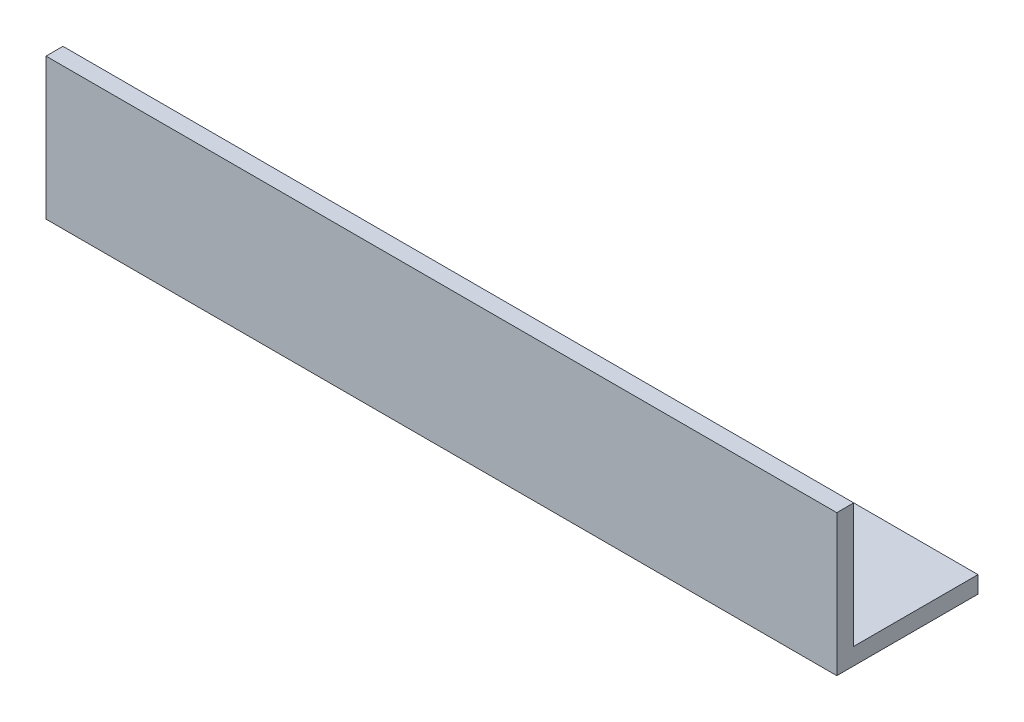
ISO-10303-21;
HEADER;
FILE_DESCRIPTION(('STEP AP214'),'2;1');
FILE_NAME('part.step','',(''),(''),'','','');
FILE_SCHEMA(('AUTOMOTIVE_DESIGN { 1 0 10303 214 1 1 1 1 }'));
ENDSEC;
DATA;
#1=APPLICATION_CONTEXT('core data for automotive mechanical design processes');
#2=APPLICATION_PROTOCOL_DEFINITION('international standard','automotive_design',2000,#1);
#3=PRODUCT_CONTEXT('',#1,'mechanical');
#4=PRODUCT('Part','Part','',(#3));
#5=PRODUCT_RELATED_PRODUCT_CATEGORY('part','',(#4));
#6=PRODUCT_DEFINITION_FORMATION('','',#4);
#7=PRODUCT_DEFINITION_CONTEXT('part definition',#1,'design');
#8=PRODUCT_DEFINITION('design','',#6,#7);
#9=PRODUCT_DEFINITION_SHAPE('','',#8);
#10=(LENGTH_UNIT() NAMED_UNIT(*) SI_UNIT(.MILLI.,.METRE.));
#11=(NAMED_UNIT(*) PLANE_ANGLE_UNIT() SI_UNIT($,.RADIAN.));
#12=(NAMED_UNIT(*) SI_UNIT($,.STERADIAN.) SOLID_ANGLE_UNIT());
#13=UNCERTAINTY_MEASURE_WITH_UNIT(LENGTH_MEASURE(1.E-05),#10,'distance_accuracy_value','');
#14=(GEOMETRIC_REPRESENTATION_CONTEXT(3) GLOBAL_UNCERTAINTY_ASSIGNED_CONTEXT((#13)) GLOBAL_UNIT_ASSIGNED_CONTEXT((#10,
#11,#12)) REPRESENTATION_CONTEXT('',''));
#15=CARTESIAN_POINT('',(0.,0.,0.));
#16=DIRECTION('',(0.,0.,1.));
#17=DIRECTION('',(1.,0.,0.));
#18=AXIS2_PLACEMENT_3D('',#15,#16,#17);
#19=CARTESIAN_POINT('',(140.,25.,-3.));
#20=DIRECTION('',(0.,-1.,0.));
#21=DIRECTION('',(0.,0.,-1.));
#22=AXIS2_PLACEMENT_3D('',#19,#20,#21);
#23=PLANE('',#22);
#24=DIRECTION('',(0.,0.,1.));
#25=VECTOR('',#24,1.);
#26=CARTESIAN_POINT('',(0.,25.,-3.));
#27=LINE('',#26,#25);
#28=CARTESIAN_POINT('',(0.,25.,-3.));
#29=VERTEX_POINT('',#28);
#30=CARTESIAN_POINT('',(0.,25.,0.));
#31=VERTEX_POINT('',#30);
#32=EDGE_CURVE('E118',#29,#31,#27,.T.);
#33=ORIENTED_EDGE('',*,*,#32,.T.);
#34=DIRECTION('',(-1.,0.,0.));
#35=VECTOR('',#34,1.);
#36=CARTESIAN_POINT('',(140.,25.,0.));
#37=LINE('',#36,#35);
#38=CARTESIAN_POINT('',(140.,25.,0.));
#39=VERTEX_POINT('',#38);
#40=EDGE_CURVE('E11',#39,#31,#37,.T.);
#41=ORIENTED_EDGE('',*,*,#40,.F.);
#42=DIRECTION('',(0.,0.,1.));
#43=VECTOR('',#42,1.);
#44=CARTESIAN_POINT('',(140.,25.,-3.));
#45=LINE('',#44,#43);
#46=CARTESIAN_POINT('',(140.,25.,-3.));
#47=VERTEX_POINT('',#46);
#48=EDGE_CURVE('E128',#47,#39,#45,.T.);
#49=ORIENTED_EDGE('',*,*,#48,.F.);
#50=DIRECTION('',(-1.,0.,0.));
#51=VECTOR('',#50,1.);
#52=CARTESIAN_POINT('',(140.,25.,-3.));
#53=LINE('',#52,#51);
#54=EDGE_CURVE('E114',#47,#29,#53,.T.);
#55=ORIENTED_EDGE('',*,*,#54,.T.);
#56=EDGE_LOOP('',(#33,#41,#49,#55));
#57=FACE_BOUND('',#56,.T.);
#58=ADVANCED_FACE('F34',(#57),#23,.F.);
#59=CARTESIAN_POINT('',(140.,25.,0.));
#60=DIRECTION('',(0.,0.,-1.));
#61=DIRECTION('',(0.,1.,0.));
#62=AXIS2_PLACEMENT_3D('',#59,#60,#61);
#63=PLANE('',#62);
#64=DIRECTION('',(0.,-1.,0.));
#65=VECTOR('',#64,1.);
#66=CARTESIAN_POINT('',(0.,25.,0.));
#67=LINE('',#66,#65);
#68=CARTESIAN_POINT('',(0.,0.,0.));
#69=VERTEX_POINT('',#68);
#70=EDGE_CURVE('E121',#31,#69,#67,.T.);
#71=ORIENTED_EDGE('',*,*,#70,.T.);
#72=DIRECTION('',(-1.,0.,0.));
#73=VECTOR('',#72,1.);
#74=CARTESIAN_POINT('',(140.,0.,0.));
#75=LINE('',#74,#73);
#76=CARTESIAN_POINT('',(140.,0.,0.));
#77=VERTEX_POINT('',#76);
#78=EDGE_CURVE('E42',#77,#69,#75,.T.);
#79=ORIENTED_EDGE('',*,*,#78,.F.);
#80=DIRECTION('',(0.,-1.,0.));
#81=VECTOR('',#80,1.);
#82=CARTESIAN_POINT('',(140.,25.,0.));
#83=LINE('',#82,#81);
#84=EDGE_CURVE('E87',#39,#77,#83,.T.);
#85=ORIENTED_EDGE('',*,*,#84,.F.);
#86=ORIENTED_EDGE('',*,*,#40,.T.);
#87=EDGE_LOOP('',(#71,#79,#85,#86));
#88=FACE_BOUND('',#87,.T.);
#89=ADVANCED_FACE('F152',(#88),#63,.F.);
#90=CARTESIAN_POINT('',(140.,0.,0.));
#91=DIRECTION('',(0.,1.,0.));
#92=DIRECTION('',(0.,0.,1.));
#93=AXIS2_PLACEMENT_3D('',#90,#91,#92);
#94=PLANE('',#93);
#95=DIRECTION('',(0.,0.,-1.));
#96=VECTOR('',#95,1.);
#97=CARTESIAN_POINT('',(0.,0.,0.));
#98=LINE('',#97,#96);
#99=CARTESIAN_POINT('',(0.,0.,-25.));
#100=VERTEX_POINT('',#99);
#101=EDGE_CURVE('E123',#69,#100,#98,.T.);
#102=ORIENTED_EDGE('',*,*,#101,.T.);
#103=DIRECTION('',(-1.,0.,0.));
#104=VECTOR('',#103,1.);
#105=CARTESIAN_POINT('',(140.,0.,-25.));
#106=LINE('',#105,#104);
#107=CARTESIAN_POINT('',(140.,0.,-25.));
#108=VERTEX_POINT('',#107);
#109=EDGE_CURVE('E109',#108,#100,#106,.T.);
#110=ORIENTED_EDGE('',*,*,#109,.F.);
#111=DIRECTION('',(0.,0.,-1.));
#112=VECTOR('',#111,1.);
#113=CARTESIAN_POINT('',(140.,0.,0.));
#114=LINE('',#113,#112);
#115=EDGE_CURVE('E100',#77,#108,#114,.T.);
#116=ORIENTED_EDGE('',*,*,#115,.F.);
#117=ORIENTED_EDGE('',*,*,#78,.T.);
#118=EDGE_LOOP('',(#102,#110,#116,#117));
#119=FACE_BOUND('',#118,.T.);
#120=ADVANCED_FACE('F134',(#119),#94,.F.);
#121=CARTESIAN_POINT('',(140.,0.,-25.));
#122=DIRECTION('',(0.,0.,1.));
#123=DIRECTION('',(1.,0.,0.));
#124=AXIS2_PLACEMENT_3D('',#121,#122,#123);
#125=PLANE('',#124);
#126=DIRECTION('',(0.,1.,0.));
#127=VECTOR('',#126,1.);
#128=CARTESIAN_POINT('',(0.,0.,-25.));
#129=LINE('',#128,#127);
#130=CARTESIAN_POINT('',(0.,3.,-25.));
#131=VERTEX_POINT('',#130);
#132=EDGE_CURVE('E108',#100,#131,#129,.T.);
#133=ORIENTED_EDGE('',*,*,#132,.T.);
#134=DIRECTION('',(-1.,0.,0.));
#135=VECTOR('',#134,1.);
#136=CARTESIAN_POINT('',(140.,3.,-25.));
#137=LINE('',#136,#135);
#138=CARTESIAN_POINT('',(140.,3.,-25.));
#139=VERTEX_POINT('',#138);
#140=EDGE_CURVE('E105',#139,#131,#137,.T.);
#141=ORIENTED_EDGE('',*,*,#140,.F.);
#142=DIRECTION('',(0.,1.,0.));
#143=VECTOR('',#142,1.);
#144=CARTESIAN_POINT('',(140.,0.,-25.));
#145=LINE('',#144,#143);
#146=EDGE_CURVE('E94',#108,#139,#145,.T.);
#147=ORIENTED_EDGE('',*,*,#146,.F.);
#148=ORIENTED_EDGE('',*,*,#109,.T.);
#149=EDGE_LOOP('',(#133,#141,#147,#148));
#150=FACE_BOUND('',#149,.T.);
#151=ADVANCED_FACE('F106',(#150),#125,.F.);
#152=CARTESIAN_POINT('',(140.,3.,-25.));
#153=DIRECTION('',(0.,-1.,0.));
#154=DIRECTION('',(0.,0.,-1.));
#155=AXIS2_PLACEMENT_3D('',#152,#153,#154);
#156=PLANE('',#155);
#157=DIRECTION('',(0.,0.,1.));
#158=VECTOR('',#157,1.);
#159=CARTESIAN_POINT('',(0.,3.,-25.));
#160=LINE('',#159,#158);
#161=CARTESIAN_POINT('',(0.,3.,-3.));
#162=VERTEX_POINT('',#161);
#163=EDGE_CURVE('E73',#131,#162,#160,.T.);
#164=ORIENTED_EDGE('',*,*,#163,.T.);
#165=DIRECTION('',(-1.,0.,0.));
#166=VECTOR('',#165,1.);
#167=CARTESIAN_POINT('',(140.,3.,-3.));
#168=LINE('',#167,#166);
#169=CARTESIAN_POINT('',(140.,3.,-3.));
#170=VERTEX_POINT('',#169);
#171=EDGE_CURVE('E110',#170,#162,#168,.T.);
#172=ORIENTED_EDGE('',*,*,#171,.F.);
#173=DIRECTION('',(0.,0.,1.));
#174=VECTOR('',#173,1.);
#175=CARTESIAN_POINT('',(140.,3.,-25.));
#176=LINE('',#175,#174);
#177=EDGE_CURVE('E98',#139,#170,#176,.T.);
#178=ORIENTED_EDGE('',*,*,#177,.F.);
#179=ORIENTED_EDGE('',*,*,#140,.T.);
#180=EDGE_LOOP('',(#164,#172,#178,#179));
#181=FACE_BOUND('',#180,.T.);
#182=ADVANCED_FACE('F112',(#181),#156,.F.);
#183=CARTESIAN_POINT('',(140.,3.,-3.));
#184=DIRECTION('',(0.,0.,1.));
#185=DIRECTION('',(1.,0.,0.));
#186=AXIS2_PLACEMENT_3D('',#183,#184,#185);
#187=PLANE('',#186);
#188=DIRECTION('',(0.,1.,0.));
#189=VECTOR('',#188,1.);
#190=CARTESIAN_POINT('',(0.,3.,-3.));
#191=LINE('',#190,#189);
#192=EDGE_CURVE('E79',#162,#29,#191,.T.);
#193=ORIENTED_EDGE('',*,*,#192,.T.);
#194=ORIENTED_EDGE('',*,*,#54,.F.);
#195=DIRECTION('',(0.,1.,0.));
#196=VECTOR('',#195,1.);
#197=CARTESIAN_POINT('',(140.,3.,-3.));
#198=LINE('',#197,#196);
#199=EDGE_CURVE('E50',#170,#47,#198,.T.);
#200=ORIENTED_EDGE('',*,*,#199,.F.);
#201=ORIENTED_EDGE('',*,*,#171,.T.);
#202=EDGE_LOOP('',(#193,#194,#200,#201));
#203=FACE_BOUND('',#202,.T.);
#204=ADVANCED_FACE('F141',(#203),#187,.F.);
#205=CARTESIAN_POINT('',(140.,0.,0.));
#206=DIRECTION('',(1.,0.,0.));
#207=DIRECTION('',(0.,0.,-1.));
#208=AXIS2_PLACEMENT_3D('',#205,#206,#207);
#209=PLANE('',#208);
#210=ORIENTED_EDGE('',*,*,#48,.T.);
#211=ORIENTED_EDGE('',*,*,#84,.T.);
#212=ORIENTED_EDGE('',*,*,#115,.T.);
#213=ORIENTED_EDGE('',*,*,#146,.T.);
#214=ORIENTED_EDGE('',*,*,#177,.T.);
#215=ORIENTED_EDGE('',*,*,#199,.T.);
#216=EDGE_LOOP('',(#210,#211,#212,#213,#214,#215));
#217=FACE_BOUND('',#216,.T.);
#218=ADVANCED_FACE('F96',(#217),#209,.T.);
#219=CARTESIAN_POINT('',(0.,0.,0.));
#220=DIRECTION('',(1.,0.,0.));
#221=DIRECTION('',(0.,0.,-1.));
#222=AXIS2_PLACEMENT_3D('',#219,#220,#221);
#223=PLANE('',#222);
#224=ORIENTED_EDGE('',*,*,#32,.F.);
#225=ORIENTED_EDGE('',*,*,#192,.F.);
#226=ORIENTED_EDGE('',*,*,#163,.F.);
#227=ORIENTED_EDGE('',*,*,#132,.F.);
#228=ORIENTED_EDGE('',*,*,#101,.F.);
#229=ORIENTED_EDGE('',*,*,#70,.F.);
#230=EDGE_LOOP('',(#224,#225,#226,#227,#228,#229));
#231=FACE_BOUND('',#230,.T.);
#232=ADVANCED_FACE('F137',(#231),#223,.F.);
#233=CLOSED_SHELL('',(#58,#89,#120,#151,#182,#204,#218,#232));
#234=MANIFOLD_SOLID_BREP('B2',#233);
#235=ADVANCED_BREP_SHAPE_REPRESENTATION('',(#18,#234),#14);
#236=SHAPE_DEFINITION_REPRESENTATION(#9,#235);
ENDSEC;
END-ISO-10303-21;
